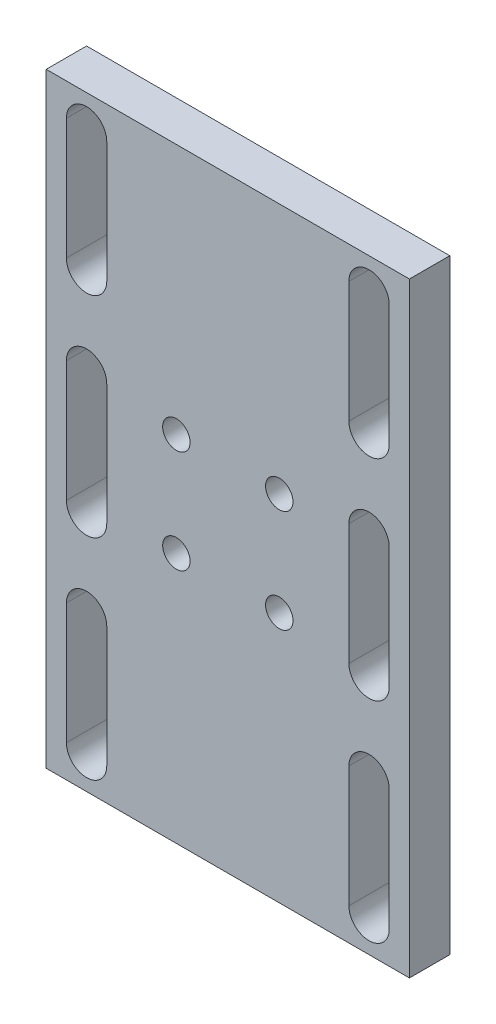
ISO-10303-21;
HEADER;
FILE_DESCRIPTION(('STEP AP214'),'2;1');
FILE_NAME('part.step','',(''),(''),'','','');
FILE_SCHEMA(('AUTOMOTIVE_DESIGN { 1 0 10303 214 1 1 1 1 }'));
ENDSEC;
DATA;
#1=APPLICATION_CONTEXT('core data for automotive mechanical design processes');
#2=APPLICATION_PROTOCOL_DEFINITION('international standard','automotive_design',2000,#1);
#3=PRODUCT_CONTEXT('',#1,'mechanical');
#4=PRODUCT('Part','Part','',(#3));
#5=PRODUCT_RELATED_PRODUCT_CATEGORY('part','',(#4));
#6=PRODUCT_DEFINITION_FORMATION('','',#4);
#7=PRODUCT_DEFINITION_CONTEXT('part definition',#1,'design');
#8=PRODUCT_DEFINITION('design','',#6,#7);
#9=PRODUCT_DEFINITION_SHAPE('','',#8);
#10=(LENGTH_UNIT() NAMED_UNIT(*) SI_UNIT(.MILLI.,.METRE.));
#11=(NAMED_UNIT(*) PLANE_ANGLE_UNIT() SI_UNIT($,.RADIAN.));
#12=(NAMED_UNIT(*) SI_UNIT($,.STERADIAN.) SOLID_ANGLE_UNIT());
#13=UNCERTAINTY_MEASURE_WITH_UNIT(LENGTH_MEASURE(1.E-05),#10,'distance_accuracy_value','');
#14=(GEOMETRIC_REPRESENTATION_CONTEXT(3) GLOBAL_UNCERTAINTY_ASSIGNED_CONTEXT((#13)) GLOBAL_UNIT_ASSIGNED_CONTEXT((#10,
#11,#12)) REPRESENTATION_CONTEXT('',''));
#15=CARTESIAN_POINT('',(0.,0.,0.));
#16=DIRECTION('',(0.,0.,1.));
#17=DIRECTION('',(1.,0.,0.));
#18=AXIS2_PLACEMENT_3D('',#15,#16,#17);
#19=CARTESIAN_POINT('',(-45.,0.,10.));
#20=DIRECTION('',(1.,0.,0.));
#21=DIRECTION('',(0.,1.,0.));
#22=AXIS2_PLACEMENT_3D('',#19,#20,#21);
#23=PLANE('',#22);
#24=DIRECTION('',(0.,-1.,0.));
#25=VECTOR('',#24,1.);
#26=CARTESIAN_POINT('',(-45.,0.,0.));
#27=LINE('',#26,#25);
#28=CARTESIAN_POINT('',(-45.,150.,0.));
#29=VERTEX_POINT('',#28);
#30=CARTESIAN_POINT('',(-45.,0.,0.));
#31=VERTEX_POINT('',#30);
#32=EDGE_CURVE('E322',#29,#31,#27,.T.);
#33=ORIENTED_EDGE('',*,*,#32,.T.);
#34=DIRECTION('',(0.,0.,-1.));
#35=VECTOR('',#34,1.);
#36=CARTESIAN_POINT('',(-45.,0.,10.));
#37=LINE('',#36,#35);
#38=CARTESIAN_POINT('',(-45.,0.,10.));
#39=VERTEX_POINT('',#38);
#40=EDGE_CURVE('E11',#39,#31,#37,.T.);
#41=ORIENTED_EDGE('',*,*,#40,.F.);
#42=DIRECTION('',(0.,-1.,0.));
#43=VECTOR('',#42,1.);
#44=CARTESIAN_POINT('',(-45.,0.,10.));
#45=LINE('',#44,#43);
#46=CARTESIAN_POINT('',(-45.,150.,10.));
#47=VERTEX_POINT('',#46);
#48=EDGE_CURVE('E235',#47,#39,#45,.T.);
#49=ORIENTED_EDGE('',*,*,#48,.F.);
#50=DIRECTION('',(0.,0.,-1.));
#51=VECTOR('',#50,1.);
#52=CARTESIAN_POINT('',(-45.,150.,10.));
#53=LINE('',#52,#51);
#54=EDGE_CURVE('E54',#47,#29,#53,.T.);
#55=ORIENTED_EDGE('',*,*,#54,.T.);
#56=EDGE_LOOP('',(#33,#41,#49,#55));
#57=FACE_BOUND('',#56,.T.);
#58=ADVANCED_FACE('F35',(#57),#23,.F.);
#59=CARTESIAN_POINT('',(0.,0.,10.));
#60=DIRECTION('',(0.,1.,0.));
#61=DIRECTION('',(0.,0.,1.));
#62=AXIS2_PLACEMENT_3D('',#59,#60,#61);
#63=PLANE('',#62);
#64=DIRECTION('',(1.,0.,0.));
#65=VECTOR('',#64,1.);
#66=CARTESIAN_POINT('',(0.,0.,0.));
#67=LINE('',#66,#65);
#68=CARTESIAN_POINT('',(45.,0.,0.));
#69=VERTEX_POINT('',#68);
#70=EDGE_CURVE('E241',#31,#69,#67,.T.);
#71=ORIENTED_EDGE('',*,*,#70,.T.);
#72=DIRECTION('',(0.,0.,-1.));
#73=VECTOR('',#72,1.);
#74=CARTESIAN_POINT('',(45.,0.,10.));
#75=LINE('',#74,#73);
#76=CARTESIAN_POINT('',(45.,0.,10.));
#77=VERTEX_POINT('',#76);
#78=EDGE_CURVE('E45',#77,#69,#75,.T.);
#79=ORIENTED_EDGE('',*,*,#78,.F.);
#80=DIRECTION('',(1.,0.,0.));
#81=VECTOR('',#80,1.);
#82=CARTESIAN_POINT('',(0.,0.,10.));
#83=LINE('',#82,#81);
#84=EDGE_CURVE('E229',#39,#77,#83,.T.);
#85=ORIENTED_EDGE('',*,*,#84,.F.);
#86=ORIENTED_EDGE('',*,*,#40,.T.);
#87=EDGE_LOOP('',(#71,#79,#85,#86));
#88=FACE_BOUND('',#87,.T.);
#89=ADVANCED_FACE('F240',(#88),#63,.F.);
#90=CARTESIAN_POINT('',(45.,0.,10.));
#91=DIRECTION('',(1.,0.,0.));
#92=DIRECTION('',(0.,1.,0.));
#93=AXIS2_PLACEMENT_3D('',#90,#91,#92);
#94=PLANE('',#93);
#95=DIRECTION('',(0.,-1.,0.));
#96=VECTOR('',#95,1.);
#97=CARTESIAN_POINT('',(45.,0.,0.));
#98=LINE('',#97,#96);
#99=CARTESIAN_POINT('',(45.,150.,0.));
#100=VERTEX_POINT('',#99);
#101=EDGE_CURVE('E325',#100,#69,#98,.T.);
#102=ORIENTED_EDGE('',*,*,#101,.F.);
#103=DIRECTION('',(0.,0.,-1.));
#104=VECTOR('',#103,1.);
#105=CARTESIAN_POINT('',(45.,150.,10.));
#106=LINE('',#105,#104);
#107=CARTESIAN_POINT('',(45.,150.,10.));
#108=VERTEX_POINT('',#107);
#109=EDGE_CURVE('E140',#108,#100,#106,.T.);
#110=ORIENTED_EDGE('',*,*,#109,.F.);
#111=DIRECTION('',(0.,-1.,0.));
#112=VECTOR('',#111,1.);
#113=CARTESIAN_POINT('',(45.,0.,10.));
#114=LINE('',#113,#112);
#115=EDGE_CURVE('E234',#108,#77,#114,.T.);
#116=ORIENTED_EDGE('',*,*,#115,.T.);
#117=ORIENTED_EDGE('',*,*,#78,.T.);
#118=EDGE_LOOP('',(#102,#110,#116,#117));
#119=FACE_BOUND('',#118,.T.);
#120=ADVANCED_FACE('F245',(#119),#94,.T.);
#121=CARTESIAN_POINT('',(35.,112.,10.));
#122=DIRECTION('',(0.,0.,-1.));
#123=DIRECTION('',(-1.,0.,0.));
#124=AXIS2_PLACEMENT_3D('',#121,#122,#123);
#125=CYLINDRICAL_SURFACE('',#124,5.00000000000001);
#126=CARTESIAN_POINT('',(35.,112.,0.));
#127=DIRECTION('',(0.,0.,1.));
#128=DIRECTION('',(1.,0.,0.));
#129=AXIS2_PLACEMENT_3D('',#126,#127,#128);
#130=CIRCLE('',#129,5.00000000000001);
#131=CARTESIAN_POINT('',(30.,112.,0.));
#132=VERTEX_POINT('',#131);
#133=CARTESIAN_POINT('',(40.,112.,0.));
#134=VERTEX_POINT('',#133);
#135=EDGE_CURVE('E310',#132,#134,#130,.T.);
#136=ORIENTED_EDGE('',*,*,#135,.F.);
#137=DIRECTION('',(0.,0.,-1.));
#138=VECTOR('',#137,1.);
#139=CARTESIAN_POINT('',(30.,112.,10.));
#140=LINE('',#139,#138);
#141=CARTESIAN_POINT('',(30.,112.,10.));
#142=VERTEX_POINT('',#141);
#143=EDGE_CURVE('E332',#142,#132,#140,.T.);
#144=ORIENTED_EDGE('',*,*,#143,.F.);
#145=CARTESIAN_POINT('',(35.,112.,10.));
#146=DIRECTION('',(0.,0.,1.));
#147=DIRECTION('',(1.,0.,0.));
#148=AXIS2_PLACEMENT_3D('',#145,#146,#147);
#149=CIRCLE('',#148,5.00000000000001);
#150=CARTESIAN_POINT('',(40.,112.,10.));
#151=VERTEX_POINT('',#150);
#152=EDGE_CURVE('E450',#142,#151,#149,.T.);
#153=ORIENTED_EDGE('',*,*,#152,.T.);
#154=DIRECTION('',(0.,0.,-1.));
#155=VECTOR('',#154,1.);
#156=CARTESIAN_POINT('',(40.,112.,10.));
#157=LINE('',#156,#155);
#158=EDGE_CURVE('E334',#151,#134,#157,.T.);
#159=ORIENTED_EDGE('',*,*,#158,.T.);
#160=EDGE_LOOP('',(#136,#144,#153,#159));
#161=FACE_BOUND('',#160,.T.);
#162=ADVANCED_FACE('F471',(#161),#125,.F.);
#163=CARTESIAN_POINT('',(30.,0.,10.));
#164=DIRECTION('',(1.,0.,0.));
#165=DIRECTION('',(0.,0.,-1.));
#166=AXIS2_PLACEMENT_3D('',#163,#164,#165);
#167=PLANE('',#166);
#168=DIRECTION('',(0.,-1.,0.));
#169=VECTOR('',#168,1.);
#170=CARTESIAN_POINT('',(30.,0.,0.));
#171=LINE('',#170,#169);
#172=CARTESIAN_POINT('',(30.,142.,0.));
#173=VERTEX_POINT('',#172);
#174=EDGE_CURVE('E313',#173,#132,#171,.T.);
#175=ORIENTED_EDGE('',*,*,#174,.F.);
#176=DIRECTION('',(0.,0.,-1.));
#177=VECTOR('',#176,1.);
#178=CARTESIAN_POINT('',(30.,142.,10.));
#179=LINE('',#178,#177);
#180=CARTESIAN_POINT('',(30.,142.,10.));
#181=VERTEX_POINT('',#180);
#182=EDGE_CURVE('E339',#181,#173,#179,.T.);
#183=ORIENTED_EDGE('',*,*,#182,.F.);
#184=DIRECTION('',(0.,-1.,0.));
#185=VECTOR('',#184,1.);
#186=CARTESIAN_POINT('',(30.,0.,10.));
#187=LINE('',#186,#185);
#188=EDGE_CURVE('E453',#181,#142,#187,.T.);
#189=ORIENTED_EDGE('',*,*,#188,.T.);
#190=ORIENTED_EDGE('',*,*,#143,.T.);
#191=EDGE_LOOP('',(#175,#183,#189,#190));
#192=FACE_BOUND('',#191,.T.);
#193=ADVANCED_FACE('F474',(#192),#167,.T.);
#194=CARTESIAN_POINT('',(35.,142.,10.));
#195=DIRECTION('',(0.,0.,-1.));
#196=DIRECTION('',(-1.,0.,0.));
#197=AXIS2_PLACEMENT_3D('',#194,#195,#196);
#198=CYLINDRICAL_SURFACE('',#197,5.00000000000001);
#199=CARTESIAN_POINT('',(35.,142.,0.));
#200=DIRECTION('',(0.,0.,1.));
#201=DIRECTION('',(1.,0.,0.));
#202=AXIS2_PLACEMENT_3D('',#199,#200,#201);
#203=CIRCLE('',#202,5.00000000000001);
#204=CARTESIAN_POINT('',(40.,142.,0.));
#205=VERTEX_POINT('',#204);
#206=EDGE_CURVE('E316',#205,#173,#203,.T.);
#207=ORIENTED_EDGE('',*,*,#206,.F.);
#208=DIRECTION('',(0.,0.,-1.));
#209=VECTOR('',#208,1.);
#210=CARTESIAN_POINT('',(40.,142.,10.));
#211=LINE('',#210,#209);
#212=CARTESIAN_POINT('',(40.,142.,10.));
#213=VERTEX_POINT('',#212);
#214=EDGE_CURVE('E336',#213,#205,#211,.T.);
#215=ORIENTED_EDGE('',*,*,#214,.F.);
#216=CARTESIAN_POINT('',(35.,142.,10.));
#217=DIRECTION('',(0.,0.,1.));
#218=DIRECTION('',(1.,0.,0.));
#219=AXIS2_PLACEMENT_3D('',#216,#217,#218);
#220=CIRCLE('',#219,5.00000000000001);
#221=EDGE_CURVE('E456',#213,#181,#220,.T.);
#222=ORIENTED_EDGE('',*,*,#221,.T.);
#223=ORIENTED_EDGE('',*,*,#182,.T.);
#224=EDGE_LOOP('',(#207,#215,#222,#223));
#225=FACE_BOUND('',#224,.T.);
#226=ADVANCED_FACE('F477',(#225),#198,.F.);
#227=CARTESIAN_POINT('',(-30.,0.,10.));
#228=DIRECTION('',(1.,0.,0.));
#229=DIRECTION('',(0.,0.,-1.));
#230=AXIS2_PLACEMENT_3D('',#227,#228,#229);
#231=PLANE('',#230);
#232=DIRECTION('',(0.,-1.,0.));
#233=VECTOR('',#232,1.);
#234=CARTESIAN_POINT('',(-30.,0.,0.));
#235=LINE('',#234,#233);
#236=CARTESIAN_POINT('',(-30.,142.,0.));
#237=VERTEX_POINT('',#236);
#238=CARTESIAN_POINT('',(-30.,112.,0.));
#239=VERTEX_POINT('',#238);
#240=EDGE_CURVE('E299',#237,#239,#235,.T.);
#241=ORIENTED_EDGE('',*,*,#240,.T.);
#242=DIRECTION('',(0.,0.,-1.));
#243=VECTOR('',#242,1.);
#244=CARTESIAN_POINT('',(-30.,112.,10.));
#245=LINE('',#244,#243);
#246=CARTESIAN_POINT('',(-30.,112.,10.));
#247=VERTEX_POINT('',#246);
#248=EDGE_CURVE('E337',#247,#239,#245,.T.);
#249=ORIENTED_EDGE('',*,*,#248,.F.);
#250=DIRECTION('',(0.,-1.,0.));
#251=VECTOR('',#250,1.);
#252=CARTESIAN_POINT('',(-30.,0.,10.));
#253=LINE('',#252,#251);
#254=CARTESIAN_POINT('',(-30.,142.,10.));
#255=VERTEX_POINT('',#254);
#256=EDGE_CURVE('E440',#255,#247,#253,.T.);
#257=ORIENTED_EDGE('',*,*,#256,.F.);
#258=DIRECTION('',(0.,0.,-1.));
#259=VECTOR('',#258,1.);
#260=CARTESIAN_POINT('',(-30.,142.,10.));
#261=LINE('',#260,#259);
#262=EDGE_CURVE('E342',#255,#237,#261,.T.);
#263=ORIENTED_EDGE('',*,*,#262,.T.);
#264=EDGE_LOOP('',(#241,#249,#257,#263));
#265=FACE_BOUND('',#264,.T.);
#266=ADVANCED_FACE('F504',(#265),#231,.F.);
#267=CARTESIAN_POINT('',(-35.,112.,10.));
#268=DIRECTION('',(0.,0.,-1.));
#269=DIRECTION('',(-1.,0.,0.));
#270=AXIS2_PLACEMENT_3D('',#267,#268,#269);
#271=CYLINDRICAL_SURFACE('',#270,5.00000000000001);
#272=CARTESIAN_POINT('',(-35.,112.,0.));
#273=DIRECTION('',(0.,0.,1.));
#274=DIRECTION('',(1.,0.,0.));
#275=AXIS2_PLACEMENT_3D('',#272,#273,#274);
#276=CIRCLE('',#275,5.00000000000001);
#277=CARTESIAN_POINT('',(-40.,112.,0.));
#278=VERTEX_POINT('',#277);
#279=EDGE_CURVE('E302',#239,#278,#276,.F.);
#280=ORIENTED_EDGE('',*,*,#279,.T.);
#281=DIRECTION('',(0.,0.,-1.));
#282=VECTOR('',#281,1.);
#283=CARTESIAN_POINT('',(-40.,112.,10.));
#284=LINE('',#283,#282);
#285=CARTESIAN_POINT('',(-40.,112.,10.));
#286=VERTEX_POINT('',#285);
#287=EDGE_CURVE('E348',#286,#278,#284,.T.);
#288=ORIENTED_EDGE('',*,*,#287,.F.);
#289=CARTESIAN_POINT('',(-35.,112.,10.));
#290=DIRECTION('',(0.,0.,1.));
#291=DIRECTION('',(1.,0.,0.));
#292=AXIS2_PLACEMENT_3D('',#289,#290,#291);
#293=CIRCLE('',#292,5.00000000000001);
#294=EDGE_CURVE('E443',#247,#286,#293,.F.);
#295=ORIENTED_EDGE('',*,*,#294,.F.);
#296=ORIENTED_EDGE('',*,*,#248,.T.);
#297=EDGE_LOOP('',(#280,#288,#295,#296));
#298=FACE_BOUND('',#297,.T.);
#299=ADVANCED_FACE('F517',(#298),#271,.F.);
#300=CARTESIAN_POINT('',(-40.,0.,10.));
#301=DIRECTION('',(1.,0.,0.));
#302=DIRECTION('',(0.,0.,-1.));
#303=AXIS2_PLACEMENT_3D('',#300,#301,#302);
#304=PLANE('',#303);
#305=DIRECTION('',(0.,-1.,0.));
#306=VECTOR('',#305,1.);
#307=CARTESIAN_POINT('',(-40.,0.,0.));
#308=LINE('',#307,#306);
#309=CARTESIAN_POINT('',(-40.,142.,0.));
#310=VERTEX_POINT('',#309);
#311=EDGE_CURVE('E305',#310,#278,#308,.T.);
#312=ORIENTED_EDGE('',*,*,#311,.F.);
#313=DIRECTION('',(0.,0.,-1.));
#314=VECTOR('',#313,1.);
#315=CARTESIAN_POINT('',(-40.,142.,10.));
#316=LINE('',#315,#314);
#317=CARTESIAN_POINT('',(-40.,142.,10.));
#318=VERTEX_POINT('',#317);
#319=EDGE_CURVE('E345',#318,#310,#316,.T.);
#320=ORIENTED_EDGE('',*,*,#319,.F.);
#321=DIRECTION('',(0.,-1.,0.));
#322=VECTOR('',#321,1.);
#323=CARTESIAN_POINT('',(-40.,0.,10.));
#324=LINE('',#323,#322);
#325=EDGE_CURVE('E445',#318,#286,#324,.T.);
#326=ORIENTED_EDGE('',*,*,#325,.T.);
#327=ORIENTED_EDGE('',*,*,#287,.T.);
#328=EDGE_LOOP('',(#312,#320,#326,#327));
#329=FACE_BOUND('',#328,.T.);
#330=ADVANCED_FACE('F513',(#329),#304,.T.);
#331=CARTESIAN_POINT('',(30.,0.,10.));
#332=DIRECTION('',(-1.,0.,0.));
#333=DIRECTION('',(0.,-1.,0.));
#334=AXIS2_PLACEMENT_3D('',#331,#332,#333);
#335=PLANE('',#334);
#336=DIRECTION('',(0.,1.,0.));
#337=VECTOR('',#336,1.);
#338=CARTESIAN_POINT('',(30.,0.,0.));
#339=LINE('',#338,#337);
#340=CARTESIAN_POINT('',(30.,60.,0.));
#341=VERTEX_POINT('',#340);
#342=CARTESIAN_POINT('',(30.,90.,0.));
#343=VERTEX_POINT('',#342);
#344=EDGE_CURVE('E288',#341,#343,#339,.T.);
#345=ORIENTED_EDGE('',*,*,#344,.T.);
#346=DIRECTION('',(0.,0.,-1.));
#347=VECTOR('',#346,1.);
#348=CARTESIAN_POINT('',(30.,90.,10.));
#349=LINE('',#348,#347);
#350=CARTESIAN_POINT('',(30.,90.,10.));
#351=VERTEX_POINT('',#350);
#352=EDGE_CURVE('E346',#351,#343,#349,.T.);
#353=ORIENTED_EDGE('',*,*,#352,.F.);
#354=DIRECTION('',(0.,1.,0.));
#355=VECTOR('',#354,1.);
#356=CARTESIAN_POINT('',(30.,0.,10.));
#357=LINE('',#356,#355);
#358=CARTESIAN_POINT('',(30.,60.,10.));
#359=VERTEX_POINT('',#358);
#360=EDGE_CURVE('E430',#359,#351,#357,.T.);
#361=ORIENTED_EDGE('',*,*,#360,.F.);
#362=DIRECTION('',(0.,0.,-1.));
#363=VECTOR('',#362,1.);
#364=CARTESIAN_POINT('',(30.,60.,10.));
#365=LINE('',#364,#363);
#366=EDGE_CURVE('E352',#359,#341,#365,.T.);
#367=ORIENTED_EDGE('',*,*,#366,.T.);
#368=EDGE_LOOP('',(#345,#353,#361,#367));
#369=FACE_BOUND('',#368,.T.);
#370=ADVANCED_FACE('F516',(#369),#335,.F.);
#371=CARTESIAN_POINT('',(35.,90.,10.));
#372=DIRECTION('',(0.,0.,-1.));
#373=DIRECTION('',(-1.,0.,0.));
#374=AXIS2_PLACEMENT_3D('',#371,#372,#373);
#375=CYLINDRICAL_SURFACE('',#374,5.00000000000001);
#376=CARTESIAN_POINT('',(35.,90.,0.));
#377=DIRECTION('',(0.,0.,1.));
#378=DIRECTION('',(1.,0.,0.));
#379=AXIS2_PLACEMENT_3D('',#376,#377,#378);
#380=CIRCLE('',#379,5.00000000000001);
#381=CARTESIAN_POINT('',(40.,90.,0.));
#382=VERTEX_POINT('',#381);
#383=EDGE_CURVE('E291',#343,#382,#380,.F.);
#384=ORIENTED_EDGE('',*,*,#383,.T.);
#385=DIRECTION('',(0.,0.,-1.));
#386=VECTOR('',#385,1.);
#387=CARTESIAN_POINT('',(40.,90.,10.));
#388=LINE('',#387,#386);
#389=CARTESIAN_POINT('',(40.,90.,10.));
#390=VERTEX_POINT('',#389);
#391=EDGE_CURVE('E358',#390,#382,#388,.T.);
#392=ORIENTED_EDGE('',*,*,#391,.F.);
#393=CARTESIAN_POINT('',(35.,90.,10.));
#394=DIRECTION('',(0.,0.,1.));
#395=DIRECTION('',(1.,0.,0.));
#396=AXIS2_PLACEMENT_3D('',#393,#394,#395);
#397=CIRCLE('',#396,5.00000000000001);
#398=EDGE_CURVE('E433',#351,#390,#397,.F.);
#399=ORIENTED_EDGE('',*,*,#398,.F.);
#400=ORIENTED_EDGE('',*,*,#352,.T.);
#401=EDGE_LOOP('',(#384,#392,#399,#400));
#402=FACE_BOUND('',#401,.T.);
#403=ADVANCED_FACE('F533',(#402),#375,.F.);
#404=CARTESIAN_POINT('',(40.,0.,10.));
#405=DIRECTION('',(-1.,0.,0.));
#406=DIRECTION('',(0.,0.,1.));
#407=AXIS2_PLACEMENT_3D('',#404,#405,#406);
#408=PLANE('',#407);
#409=DIRECTION('',(0.,1.,0.));
#410=VECTOR('',#409,1.);
#411=CARTESIAN_POINT('',(40.,0.,0.));
#412=LINE('',#411,#410);
#413=CARTESIAN_POINT('',(40.,60.,0.));
#414=VERTEX_POINT('',#413);
#415=EDGE_CURVE('E294',#414,#382,#412,.T.);
#416=ORIENTED_EDGE('',*,*,#415,.F.);
#417=DIRECTION('',(0.,0.,-1.));
#418=VECTOR('',#417,1.);
#419=CARTESIAN_POINT('',(40.,60.,10.));
#420=LINE('',#419,#418);
#421=CARTESIAN_POINT('',(40.,60.,10.));
#422=VERTEX_POINT('',#421);
#423=EDGE_CURVE('E355',#422,#414,#420,.T.);
#424=ORIENTED_EDGE('',*,*,#423,.F.);
#425=DIRECTION('',(0.,1.,0.));
#426=VECTOR('',#425,1.);
#427=CARTESIAN_POINT('',(40.,0.,10.));
#428=LINE('',#427,#426);
#429=EDGE_CURVE('E435',#422,#390,#428,.T.);
#430=ORIENTED_EDGE('',*,*,#429,.T.);
#431=ORIENTED_EDGE('',*,*,#391,.T.);
#432=EDGE_LOOP('',(#416,#424,#430,#431));
#433=FACE_BOUND('',#432,.T.);
#434=ADVANCED_FACE('F529',(#433),#408,.T.);
#435=CARTESIAN_POINT('',(-35.,90.,10.));
#436=DIRECTION('',(0.,0.,-1.));
#437=DIRECTION('',(-1.,0.,0.));
#438=AXIS2_PLACEMENT_3D('',#435,#436,#437);
#439=CYLINDRICAL_SURFACE('',#438,5.00000000000001);
#440=CARTESIAN_POINT('',(-35.,90.,0.));
#441=DIRECTION('',(0.,0.,1.));
#442=DIRECTION('',(1.,0.,0.));
#443=AXIS2_PLACEMENT_3D('',#440,#441,#442);
#444=CIRCLE('',#443,5.00000000000001);
#445=CARTESIAN_POINT('',(-30.,90.,0.));
#446=VERTEX_POINT('',#445);
#447=CARTESIAN_POINT('',(-40.,90.,0.));
#448=VERTEX_POINT('',#447);
#449=EDGE_CURVE('E276',#446,#448,#444,.T.);
#450=ORIENTED_EDGE('',*,*,#449,.F.);
#451=DIRECTION('',(0.,0.,-1.));
#452=VECTOR('',#451,1.);
#453=CARTESIAN_POINT('',(-30.,90.,10.));
#454=LINE('',#453,#452);
#455=CARTESIAN_POINT('',(-30.,90.,10.));
#456=VERTEX_POINT('',#455);
#457=EDGE_CURVE('E356',#456,#446,#454,.T.);
#458=ORIENTED_EDGE('',*,*,#457,.F.);
#459=CARTESIAN_POINT('',(-35.,90.,10.));
#460=DIRECTION('',(0.,0.,1.));
#461=DIRECTION('',(1.,0.,0.));
#462=AXIS2_PLACEMENT_3D('',#459,#460,#461);
#463=CIRCLE('',#462,5.00000000000001);
#464=CARTESIAN_POINT('',(-40.,90.,10.));
#465=VERTEX_POINT('',#464);
#466=EDGE_CURVE('E419',#456,#465,#463,.T.);
#467=ORIENTED_EDGE('',*,*,#466,.T.);
#468=DIRECTION('',(0.,0.,-1.));
#469=VECTOR('',#468,1.);
#470=CARTESIAN_POINT('',(-40.,90.,10.));
#471=LINE('',#470,#469);
#472=EDGE_CURVE('E362',#465,#448,#471,.T.);
#473=ORIENTED_EDGE('',*,*,#472,.T.);
#474=EDGE_LOOP('',(#450,#458,#467,#473));
#475=FACE_BOUND('',#474,.T.);
#476=ADVANCED_FACE('F532',(#475),#439,.F.);
#477=CARTESIAN_POINT('',(-30.,0.,10.));
#478=DIRECTION('',(-1.,0.,0.));
#479=DIRECTION('',(0.,-1.,0.));
#480=AXIS2_PLACEMENT_3D('',#477,#478,#479);
#481=PLANE('',#480);
#482=DIRECTION('',(0.,1.,0.));
#483=VECTOR('',#482,1.);
#484=CARTESIAN_POINT('',(-30.,0.,0.));
#485=LINE('',#484,#483);
#486=CARTESIAN_POINT('',(-30.,60.,0.));
#487=VERTEX_POINT('',#486);
#488=EDGE_CURVE('E279',#487,#446,#485,.T.);
#489=ORIENTED_EDGE('',*,*,#488,.F.);
#490=DIRECTION('',(0.,0.,-1.));
#491=VECTOR('',#490,1.);
#492=CARTESIAN_POINT('',(-30.,60.,10.));
#493=LINE('',#492,#491);
#494=CARTESIAN_POINT('',(-30.,60.,10.));
#495=VERTEX_POINT('',#494);
#496=EDGE_CURVE('E367',#495,#487,#493,.T.);
#497=ORIENTED_EDGE('',*,*,#496,.F.);
#498=DIRECTION('',(0.,1.,0.));
#499=VECTOR('',#498,1.);
#500=CARTESIAN_POINT('',(-30.,0.,10.));
#501=LINE('',#500,#499);
#502=EDGE_CURVE('E422',#495,#456,#501,.T.);
#503=ORIENTED_EDGE('',*,*,#502,.T.);
#504=ORIENTED_EDGE('',*,*,#457,.T.);
#505=EDGE_LOOP('',(#489,#497,#503,#504));
#506=FACE_BOUND('',#505,.T.);
#507=ADVANCED_FACE('F549',(#506),#481,.T.);
#508=CARTESIAN_POINT('',(-35.,60.,10.));
#509=DIRECTION('',(0.,0.,-1.));
#510=DIRECTION('',(-1.,0.,0.));
#511=AXIS2_PLACEMENT_3D('',#508,#509,#510);
#512=CYLINDRICAL_SURFACE('',#511,5.00000000000001);
#513=CARTESIAN_POINT('',(-35.,60.,0.));
#514=DIRECTION('',(0.,0.,1.));
#515=DIRECTION('',(1.,0.,0.));
#516=AXIS2_PLACEMENT_3D('',#513,#514,#515);
#517=CIRCLE('',#516,5.00000000000001);
#518=CARTESIAN_POINT('',(-40.,60.,0.));
#519=VERTEX_POINT('',#518);
#520=EDGE_CURVE('E282',#519,#487,#517,.T.);
#521=ORIENTED_EDGE('',*,*,#520,.F.);
#522=DIRECTION('',(0.,0.,-1.));
#523=VECTOR('',#522,1.);
#524=CARTESIAN_POINT('',(-40.,60.,10.));
#525=LINE('',#524,#523);
#526=CARTESIAN_POINT('',(-40.,60.,10.));
#527=VERTEX_POINT('',#526);
#528=EDGE_CURVE('E364',#527,#519,#525,.T.);
#529=ORIENTED_EDGE('',*,*,#528,.F.);
#530=CARTESIAN_POINT('',(-35.,60.,10.));
#531=DIRECTION('',(0.,0.,1.));
#532=DIRECTION('',(1.,0.,0.));
#533=AXIS2_PLACEMENT_3D('',#530,#531,#532);
#534=CIRCLE('',#533,5.00000000000001);
#535=EDGE_CURVE('E425',#527,#495,#534,.T.);
#536=ORIENTED_EDGE('',*,*,#535,.T.);
#537=ORIENTED_EDGE('',*,*,#496,.T.);
#538=EDGE_LOOP('',(#521,#529,#536,#537));
#539=FACE_BOUND('',#538,.T.);
#540=ADVANCED_FACE('F545',(#539),#512,.F.);
#541=CARTESIAN_POINT('',(-35.,38.,10.));
#542=DIRECTION('',(0.,0.,-1.));
#543=DIRECTION('',(-1.,0.,0.));
#544=AXIS2_PLACEMENT_3D('',#541,#542,#543);
#545=CYLINDRICAL_SURFACE('',#544,5.00000000000001);
#546=CARTESIAN_POINT('',(-35.,38.,0.));
#547=DIRECTION('',(0.,0.,1.));
#548=DIRECTION('',(1.,0.,0.));
#549=AXIS2_PLACEMENT_3D('',#546,#547,#548);
#550=CIRCLE('',#549,5.00000000000001);
#551=CARTESIAN_POINT('',(-30.,38.,0.));
#552=VERTEX_POINT('',#551);
#553=CARTESIAN_POINT('',(-40.,38.,0.));
#554=VERTEX_POINT('',#553);
#555=EDGE_CURVE('E264',#552,#554,#550,.T.);
#556=ORIENTED_EDGE('',*,*,#555,.F.);
#557=DIRECTION('',(0.,0.,-1.));
#558=VECTOR('',#557,1.);
#559=CARTESIAN_POINT('',(-30.,38.,10.));
#560=LINE('',#559,#558);
#561=CARTESIAN_POINT('',(-30.,38.,10.));
#562=VERTEX_POINT('',#561);
#563=EDGE_CURVE('E365',#562,#552,#560,.T.);
#564=ORIENTED_EDGE('',*,*,#563,.F.);
#565=CARTESIAN_POINT('',(-35.,38.,10.));
#566=DIRECTION('',(0.,0.,1.));
#567=DIRECTION('',(1.,0.,0.));
#568=AXIS2_PLACEMENT_3D('',#565,#566,#567);
#569=CIRCLE('',#568,5.00000000000001);
#570=CARTESIAN_POINT('',(-40.,38.,10.));
#571=VERTEX_POINT('',#570);
#572=EDGE_CURVE('E402',#562,#571,#569,.T.);
#573=ORIENTED_EDGE('',*,*,#572,.T.);
#574=DIRECTION('',(0.,0.,-1.));
#575=VECTOR('',#574,1.);
#576=CARTESIAN_POINT('',(-40.,38.,10.));
#577=LINE('',#576,#575);
#578=EDGE_CURVE('E370',#571,#554,#577,.T.);
#579=ORIENTED_EDGE('',*,*,#578,.T.);
#580=EDGE_LOOP('',(#556,#564,#573,#579));
#581=FACE_BOUND('',#580,.T.);
#582=ADVANCED_FACE('F548',(#581),#545,.F.);
#583=CARTESIAN_POINT('',(-30.,0.,10.));
#584=DIRECTION('',(-1.,0.,0.));
#585=DIRECTION('',(0.,0.,1.));
#586=AXIS2_PLACEMENT_3D('',#583,#584,#585);
#587=PLANE('',#586);
#588=DIRECTION('',(0.,1.,0.));
#589=VECTOR('',#588,1.);
#590=CARTESIAN_POINT('',(-30.,0.,0.));
#591=LINE('',#590,#589);
#592=CARTESIAN_POINT('',(-30.,7.99999999999999,0.));
#593=VERTEX_POINT('',#592);
#594=EDGE_CURVE('E267',#593,#552,#591,.T.);
#595=ORIENTED_EDGE('',*,*,#594,.F.);
#596=DIRECTION('',(0.,0.,-1.));
#597=VECTOR('',#596,1.);
#598=CARTESIAN_POINT('',(-30.,7.99999999999999,10.));
#599=LINE('',#598,#597);
#600=CARTESIAN_POINT('',(-30.,7.99999999999999,10.));
#601=VERTEX_POINT('',#600);
#602=EDGE_CURVE('E374',#601,#593,#599,.T.);
#603=ORIENTED_EDGE('',*,*,#602,.F.);
#604=DIRECTION('',(0.,1.,0.));
#605=VECTOR('',#604,1.);
#606=CARTESIAN_POINT('',(-30.,0.,10.));
#607=LINE('',#606,#605);
#608=EDGE_CURVE('E411',#601,#562,#607,.T.);
#609=ORIENTED_EDGE('',*,*,#608,.T.);
#610=ORIENTED_EDGE('',*,*,#563,.T.);
#611=EDGE_LOOP('',(#595,#603,#609,#610));
#612=FACE_BOUND('',#611,.T.);
#613=ADVANCED_FACE('F563',(#612),#587,.T.);
#614=CARTESIAN_POINT('',(-35.,7.99999999999999,10.));
#615=DIRECTION('',(0.,0.,-1.));
#616=DIRECTION('',(-1.,0.,0.));
#617=AXIS2_PLACEMENT_3D('',#614,#615,#616);
#618=CYLINDRICAL_SURFACE('',#617,5.00000000000001);
#619=CARTESIAN_POINT('',(-35.,7.99999999999999,0.));
#620=DIRECTION('',(0.,0.,1.));
#621=DIRECTION('',(1.,0.,0.));
#622=AXIS2_PLACEMENT_3D('',#619,#620,#621);
#623=CIRCLE('',#622,5.00000000000001);
#624=CARTESIAN_POINT('',(-40.,7.99999999999999,0.));
#625=VERTEX_POINT('',#624);
#626=EDGE_CURVE('E270',#625,#593,#623,.T.);
#627=ORIENTED_EDGE('',*,*,#626,.F.);
#628=DIRECTION('',(0.,0.,-1.));
#629=VECTOR('',#628,1.);
#630=CARTESIAN_POINT('',(-40.,7.99999999999999,10.));
#631=LINE('',#630,#629);
#632=CARTESIAN_POINT('',(-40.,7.99999999999999,10.));
#633=VERTEX_POINT('',#632);
#634=EDGE_CURVE('E372',#633,#625,#631,.T.);
#635=ORIENTED_EDGE('',*,*,#634,.F.);
#636=CARTESIAN_POINT('',(-35.,7.99999999999999,10.));
#637=DIRECTION('',(0.,0.,1.));
#638=DIRECTION('',(1.,0.,0.));
#639=AXIS2_PLACEMENT_3D('',#636,#637,#638);
#640=CIRCLE('',#639,5.00000000000001);
#641=EDGE_CURVE('E414',#633,#601,#640,.T.);
#642=ORIENTED_EDGE('',*,*,#641,.T.);
#643=ORIENTED_EDGE('',*,*,#602,.T.);
#644=EDGE_LOOP('',(#627,#635,#642,#643));
#645=FACE_BOUND('',#644,.T.);
#646=ADVANCED_FACE('F560',(#645),#618,.F.);
#647=CARTESIAN_POINT('',(30.,0.,10.));
#648=DIRECTION('',(-1.,0.,0.));
#649=DIRECTION('',(0.,0.,1.));
#650=AXIS2_PLACEMENT_3D('',#647,#648,#649);
#651=PLANE('',#650);
#652=DIRECTION('',(0.,1.,0.));
#653=VECTOR('',#652,1.);
#654=CARTESIAN_POINT('',(30.,0.,0.));
#655=LINE('',#654,#653);
#656=CARTESIAN_POINT('',(30.,7.99999999999999,0.));
#657=VERTEX_POINT('',#656);
#658=CARTESIAN_POINT('',(30.,38.,0.));
#659=VERTEX_POINT('',#658);
#660=EDGE_CURVE('E252',#657,#659,#655,.T.);
#661=ORIENTED_EDGE('',*,*,#660,.T.);
#662=DIRECTION('',(0.,0.,-1.));
#663=VECTOR('',#662,1.);
#664=CARTESIAN_POINT('',(30.,38.,10.));
#665=LINE('',#664,#663);
#666=CARTESIAN_POINT('',(30.,38.,10.));
#667=VERTEX_POINT('',#666);
#668=EDGE_CURVE('E39',#667,#659,#665,.T.);
#669=ORIENTED_EDGE('',*,*,#668,.F.);
#670=DIRECTION('',(0.,1.,0.));
#671=VECTOR('',#670,1.);
#672=CARTESIAN_POINT('',(30.,0.,10.));
#673=LINE('',#672,#671);
#674=CARTESIAN_POINT('',(30.,7.99999999999999,10.));
#675=VERTEX_POINT('',#674);
#676=EDGE_CURVE('E330',#675,#667,#673,.T.);
#677=ORIENTED_EDGE('',*,*,#676,.F.);
#678=DIRECTION('',(0.,0.,-1.));
#679=VECTOR('',#678,1.);
#680=CARTESIAN_POINT('',(30.,7.99999999999999,10.));
#681=LINE('',#680,#679);
#682=EDGE_CURVE('E248',#675,#657,#681,.T.);
#683=ORIENTED_EDGE('',*,*,#682,.T.);
#684=EDGE_LOOP('',(#661,#669,#677,#683));
#685=FACE_BOUND('',#684,.T.);
#686=ADVANCED_FACE('F37',(#685),#651,.F.);
#687=CARTESIAN_POINT('',(35.,38.,10.));
#688=DIRECTION('',(0.,0.,-1.));
#689=DIRECTION('',(-1.,0.,0.));
#690=AXIS2_PLACEMENT_3D('',#687,#688,#689);
#691=CYLINDRICAL_SURFACE('',#690,5.00000000000001);
#692=CARTESIAN_POINT('',(35.,38.,0.));
#693=DIRECTION('',(0.,0.,1.));
#694=DIRECTION('',(1.,0.,0.));
#695=AXIS2_PLACEMENT_3D('',#692,#693,#694);
#696=CIRCLE('',#695,5.00000000000001);
#697=CARTESIAN_POINT('',(40.,38.,0.));
#698=VERTEX_POINT('',#697);
#699=EDGE_CURVE('E255',#659,#698,#696,.F.);
#700=ORIENTED_EDGE('',*,*,#699,.T.);
#701=DIRECTION('',(0.,0.,-1.));
#702=VECTOR('',#701,1.);
#703=CARTESIAN_POINT('',(40.,38.,10.));
#704=LINE('',#703,#702);
#705=CARTESIAN_POINT('',(40.,38.,10.));
#706=VERTEX_POINT('',#705);
#707=EDGE_CURVE('E380',#706,#698,#704,.T.);
#708=ORIENTED_EDGE('',*,*,#707,.F.);
#709=CARTESIAN_POINT('',(35.,38.,10.));
#710=DIRECTION('',(0.,0.,1.));
#711=DIRECTION('',(1.,0.,0.));
#712=AXIS2_PLACEMENT_3D('',#709,#710,#711);
#713=CIRCLE('',#712,5.00000000000001);
#714=EDGE_CURVE('E153',#667,#706,#713,.F.);
#715=ORIENTED_EDGE('',*,*,#714,.F.);
#716=ORIENTED_EDGE('',*,*,#668,.T.);
#717=EDGE_LOOP('',(#700,#708,#715,#716));
#718=FACE_BOUND('',#717,.T.);
#719=ADVANCED_FACE('F385',(#718),#691,.F.);
#720=CARTESIAN_POINT('',(40.,0.,10.));
#721=DIRECTION('',(-1.,0.,0.));
#722=DIRECTION('',(0.,0.,1.));
#723=AXIS2_PLACEMENT_3D('',#720,#721,#722);
#724=PLANE('',#723);
#725=DIRECTION('',(0.,1.,0.));
#726=VECTOR('',#725,1.);
#727=CARTESIAN_POINT('',(40.,0.,0.));
#728=LINE('',#727,#726);
#729=CARTESIAN_POINT('',(40.,7.99999999999999,0.));
#730=VERTEX_POINT('',#729);
#731=EDGE_CURVE('E259',#730,#698,#728,.T.);
#732=ORIENTED_EDGE('',*,*,#731,.F.);
#733=DIRECTION('',(0.,0.,-1.));
#734=VECTOR('',#733,1.);
#735=CARTESIAN_POINT('',(40.,7.99999999999999,10.));
#736=LINE('',#735,#734);
#737=CARTESIAN_POINT('',(40.,7.99999999999999,10.));
#738=VERTEX_POINT('',#737);
#739=EDGE_CURVE('E379',#738,#730,#736,.T.);
#740=ORIENTED_EDGE('',*,*,#739,.F.);
#741=DIRECTION('',(0.,1.,0.));
#742=VECTOR('',#741,1.);
#743=CARTESIAN_POINT('',(40.,0.,10.));
#744=LINE('',#743,#742);
#745=EDGE_CURVE('E397',#738,#706,#744,.T.);
#746=ORIENTED_EDGE('',*,*,#745,.T.);
#747=ORIENTED_EDGE('',*,*,#707,.T.);
#748=EDGE_LOOP('',(#732,#740,#746,#747));
#749=FACE_BOUND('',#748,.T.);
#750=ADVANCED_FACE('F394',(#749),#724,.T.);
#751=CARTESIAN_POINT('',(0.,150.,10.));
#752=DIRECTION('',(0.,1.,0.));
#753=DIRECTION('',(-1.,0.,0.));
#754=AXIS2_PLACEMENT_3D('',#751,#752,#753);
#755=PLANE('',#754);
#756=DIRECTION('',(1.,0.,0.));
#757=VECTOR('',#756,1.);
#758=CARTESIAN_POINT('',(0.,150.,0.));
#759=LINE('',#758,#757);
#760=EDGE_CURVE('E327',#29,#100,#759,.T.);
#761=ORIENTED_EDGE('',*,*,#760,.F.);
#762=ORIENTED_EDGE('',*,*,#54,.F.);
#763=DIRECTION('',(1.,0.,0.));
#764=VECTOR('',#763,1.);
#765=CARTESIAN_POINT('',(0.,150.,10.));
#766=LINE('',#765,#764);
#767=EDGE_CURVE('E246',#47,#108,#766,.T.);
#768=ORIENTED_EDGE('',*,*,#767,.T.);
#769=ORIENTED_EDGE('',*,*,#109,.T.);
#770=EDGE_LOOP('',(#761,#762,#768,#769));
#771=FACE_BOUND('',#770,.T.);
#772=ADVANCED_FACE('F484',(#771),#755,.T.);
#773=CARTESIAN_POINT('',(40.,0.,10.));
#774=DIRECTION('',(1.,0.,0.));
#775=DIRECTION('',(0.,0.,-1.));
#776=AXIS2_PLACEMENT_3D('',#773,#774,#775);
#777=PLANE('',#776);
#778=DIRECTION('',(0.,-1.,0.));
#779=VECTOR('',#778,1.);
#780=CARTESIAN_POINT('',(40.,0.,0.));
#781=LINE('',#780,#779);
#782=EDGE_CURVE('E319',#205,#134,#781,.T.);
#783=ORIENTED_EDGE('',*,*,#782,.T.);
#784=ORIENTED_EDGE('',*,*,#158,.F.);
#785=DIRECTION('',(0.,-1.,0.));
#786=VECTOR('',#785,1.);
#787=CARTESIAN_POINT('',(40.,0.,10.));
#788=LINE('',#787,#786);
#789=EDGE_CURVE('E459',#213,#151,#788,.T.);
#790=ORIENTED_EDGE('',*,*,#789,.F.);
#791=ORIENTED_EDGE('',*,*,#214,.T.);
#792=EDGE_LOOP('',(#783,#784,#790,#791));
#793=FACE_BOUND('',#792,.T.);
#794=ADVANCED_FACE('F467',(#793),#777,.F.);
#795=CARTESIAN_POINT('',(-35.,142.,10.));
#796=DIRECTION('',(0.,0.,-1.));
#797=DIRECTION('',(-1.,0.,0.));
#798=AXIS2_PLACEMENT_3D('',#795,#796,#797);
#799=CYLINDRICAL_SURFACE('',#798,5.00000000000001);
#800=CARTESIAN_POINT('',(-35.,142.,0.));
#801=DIRECTION('',(0.,0.,1.));
#802=DIRECTION('',(1.,0.,0.));
#803=AXIS2_PLACEMENT_3D('',#800,#801,#802);
#804=CIRCLE('',#803,5.00000000000001);
#805=EDGE_CURVE('E308',#310,#237,#804,.F.);
#806=ORIENTED_EDGE('',*,*,#805,.T.);
#807=ORIENTED_EDGE('',*,*,#262,.F.);
#808=CARTESIAN_POINT('',(-35.,142.,10.));
#809=DIRECTION('',(0.,0.,1.));
#810=DIRECTION('',(1.,0.,0.));
#811=AXIS2_PLACEMENT_3D('',#808,#809,#810);
#812=CIRCLE('',#811,5.00000000000001);
#813=EDGE_CURVE('E448',#318,#255,#812,.F.);
#814=ORIENTED_EDGE('',*,*,#813,.F.);
#815=ORIENTED_EDGE('',*,*,#319,.T.);
#816=EDGE_LOOP('',(#806,#807,#814,#815));
#817=FACE_BOUND('',#816,.T.);
#818=ADVANCED_FACE('F491',(#817),#799,.F.);
#819=CARTESIAN_POINT('',(35.,60.,10.));
#820=DIRECTION('',(0.,0.,-1.));
#821=DIRECTION('',(-1.,0.,0.));
#822=AXIS2_PLACEMENT_3D('',#819,#820,#821);
#823=CYLINDRICAL_SURFACE('',#822,5.);
#824=CARTESIAN_POINT('',(35.,60.,0.));
#825=DIRECTION('',(0.,0.,1.));
#826=DIRECTION('',(1.,0.,0.));
#827=AXIS2_PLACEMENT_3D('',#824,#825,#826);
#828=CIRCLE('',#827,5.);
#829=EDGE_CURVE('E297',#414,#341,#828,.F.);
#830=ORIENTED_EDGE('',*,*,#829,.T.);
#831=ORIENTED_EDGE('',*,*,#366,.F.);
#832=CARTESIAN_POINT('',(35.,60.,10.));
#833=DIRECTION('',(0.,0.,1.));
#834=DIRECTION('',(1.,0.,0.));
#835=AXIS2_PLACEMENT_3D('',#832,#833,#834);
#836=CIRCLE('',#835,5.);
#837=EDGE_CURVE('E438',#422,#359,#836,.F.);
#838=ORIENTED_EDGE('',*,*,#837,.F.);
#839=ORIENTED_EDGE('',*,*,#423,.T.);
#840=EDGE_LOOP('',(#830,#831,#838,#839));
#841=FACE_BOUND('',#840,.T.);
#842=ADVANCED_FACE('F511',(#841),#823,.F.);
#843=CARTESIAN_POINT('',(-40.,0.,10.));
#844=DIRECTION('',(-1.,0.,0.));
#845=DIRECTION('',(0.,0.,1.));
#846=AXIS2_PLACEMENT_3D('',#843,#844,#845);
#847=PLANE('',#846);
#848=DIRECTION('',(0.,1.,0.));
#849=VECTOR('',#848,1.);
#850=CARTESIAN_POINT('',(-40.,0.,0.));
#851=LINE('',#850,#849);
#852=EDGE_CURVE('E285',#519,#448,#851,.T.);
#853=ORIENTED_EDGE('',*,*,#852,.T.);
#854=ORIENTED_EDGE('',*,*,#472,.F.);
#855=DIRECTION('',(0.,1.,0.));
#856=VECTOR('',#855,1.);
#857=CARTESIAN_POINT('',(-40.,0.,10.));
#858=LINE('',#857,#856);
#859=EDGE_CURVE('E428',#527,#465,#858,.T.);
#860=ORIENTED_EDGE('',*,*,#859,.F.);
#861=ORIENTED_EDGE('',*,*,#528,.T.);
#862=EDGE_LOOP('',(#853,#854,#860,#861));
#863=FACE_BOUND('',#862,.T.);
#864=ADVANCED_FACE('F527',(#863),#847,.F.);
#865=CARTESIAN_POINT('',(-40.,0.,10.));
#866=DIRECTION('',(-1.,0.,0.));
#867=DIRECTION('',(0.,0.,1.));
#868=AXIS2_PLACEMENT_3D('',#865,#866,#867);
#869=PLANE('',#868);
#870=DIRECTION('',(0.,1.,0.));
#871=VECTOR('',#870,1.);
#872=CARTESIAN_POINT('',(-40.,0.,0.));
#873=LINE('',#872,#871);
#874=EDGE_CURVE('E273',#625,#554,#873,.T.);
#875=ORIENTED_EDGE('',*,*,#874,.T.);
#876=ORIENTED_EDGE('',*,*,#578,.F.);
#877=DIRECTION('',(0.,1.,0.));
#878=VECTOR('',#877,1.);
#879=CARTESIAN_POINT('',(-40.,0.,10.));
#880=LINE('',#879,#878);
#881=EDGE_CURVE('E417',#633,#571,#880,.T.);
#882=ORIENTED_EDGE('',*,*,#881,.F.);
#883=ORIENTED_EDGE('',*,*,#634,.T.);
#884=EDGE_LOOP('',(#875,#876,#882,#883));
#885=FACE_BOUND('',#884,.T.);
#886=ADVANCED_FACE('F543',(#885),#869,.F.);
#887=CARTESIAN_POINT('',(35.,7.99999999999999,10.));
#888=DIRECTION('',(0.,0.,-1.));
#889=DIRECTION('',(-1.,0.,0.));
#890=AXIS2_PLACEMENT_3D('',#887,#888,#889);
#891=CYLINDRICAL_SURFACE('',#890,5.00000000000001);
#892=CARTESIAN_POINT('',(35.,7.99999999999999,0.));
#893=DIRECTION('',(0.,0.,1.));
#894=DIRECTION('',(1.,0.,0.));
#895=AXIS2_PLACEMENT_3D('',#892,#893,#894);
#896=CIRCLE('',#895,5.00000000000001);
#897=EDGE_CURVE('E262',#730,#657,#896,.F.);
#898=ORIENTED_EDGE('',*,*,#897,.T.);
#899=ORIENTED_EDGE('',*,*,#682,.F.);
#900=CARTESIAN_POINT('',(35.,7.99999999999999,10.));
#901=DIRECTION('',(0.,0.,1.));
#902=DIRECTION('',(1.,0.,0.));
#903=AXIS2_PLACEMENT_3D('',#900,#901,#902);
#904=CIRCLE('',#903,5.00000000000001);
#905=EDGE_CURVE('E399',#738,#675,#904,.F.);
#906=ORIENTED_EDGE('',*,*,#905,.F.);
#907=ORIENTED_EDGE('',*,*,#739,.T.);
#908=EDGE_LOOP('',(#898,#899,#906,#907));
#909=FACE_BOUND('',#908,.T.);
#910=ADVANCED_FACE('F400',(#909),#891,.F.);
#911=CARTESIAN_POINT('',(0.,0.,10.));
#912=DIRECTION('',(0.,0.,1.));
#913=DIRECTION('',(1.,0.,0.));
#914=AXIS2_PLACEMENT_3D('',#911,#912,#913);
#915=PLANE('',#914);
#916=CARTESIAN_POINT('',(-12.75,87.75,10.));
#917=DIRECTION('',(0.,0.,1.));
#918=DIRECTION('',(1.,0.,0.));
#919=AXIS2_PLACEMENT_3D('',#916,#917,#918);
#920=CIRCLE('',#919,3.4);
#921=CARTESIAN_POINT('',(-9.35000000000001,87.75,10.));
#922=VERTEX_POINT('',#921);
#923=EDGE_CURVE('E792',#922,#922,#920,.T.);
#924=ORIENTED_EDGE('',*,*,#923,.F.);
#925=EDGE_LOOP('',(#924));
#926=FACE_BOUND('',#925,.T.);
#927=CARTESIAN_POINT('',(12.75,87.75,10.));
#928=DIRECTION('',(0.,0.,1.));
#929=DIRECTION('',(1.,0.,0.));
#930=AXIS2_PLACEMENT_3D('',#927,#928,#929);
#931=CIRCLE('',#930,3.4);
#932=CARTESIAN_POINT('',(16.15,87.75,10.));
#933=VERTEX_POINT('',#932);
#934=EDGE_CURVE('E796',#933,#933,#931,.T.);
#935=ORIENTED_EDGE('',*,*,#934,.F.);
#936=EDGE_LOOP('',(#935));
#937=FACE_BOUND('',#936,.T.);
#938=CARTESIAN_POINT('',(-12.75,62.25,10.));
#939=DIRECTION('',(0.,0.,1.));
#940=DIRECTION('',(1.,0.,0.));
#941=AXIS2_PLACEMENT_3D('',#938,#939,#940);
#942=CIRCLE('',#941,3.40000000000001);
#943=CARTESIAN_POINT('',(-9.35,62.25,10.));
#944=VERTEX_POINT('',#943);
#945=EDGE_CURVE('E805',#944,#944,#942,.T.);
#946=ORIENTED_EDGE('',*,*,#945,.F.);
#947=EDGE_LOOP('',(#946));
#948=FACE_BOUND('',#947,.T.);
#949=CARTESIAN_POINT('',(12.75,62.25,10.));
#950=DIRECTION('',(0.,0.,1.));
#951=DIRECTION('',(1.,0.,0.));
#952=AXIS2_PLACEMENT_3D('',#949,#950,#951);
#953=CIRCLE('',#952,3.4);
#954=CARTESIAN_POINT('',(16.15,62.25,10.));
#955=VERTEX_POINT('',#954);
#956=EDGE_CURVE('E811',#955,#955,#953,.T.);
#957=ORIENTED_EDGE('',*,*,#956,.F.);
#958=EDGE_LOOP('',(#957));
#959=FACE_BOUND('',#958,.T.);
#960=ORIENTED_EDGE('',*,*,#676,.T.);
#961=ORIENTED_EDGE('',*,*,#714,.T.);
#962=ORIENTED_EDGE('',*,*,#745,.F.);
#963=ORIENTED_EDGE('',*,*,#905,.T.);
#964=EDGE_LOOP('',(#960,#961,#962,#963));
#965=FACE_BOUND('',#964,.T.);
#966=ORIENTED_EDGE('',*,*,#572,.F.);
#967=ORIENTED_EDGE('',*,*,#608,.F.);
#968=ORIENTED_EDGE('',*,*,#641,.F.);
#969=ORIENTED_EDGE('',*,*,#881,.T.);
#970=EDGE_LOOP('',(#966,#967,#968,#969));
#971=FACE_BOUND('',#970,.T.);
#972=ORIENTED_EDGE('',*,*,#466,.F.);
#973=ORIENTED_EDGE('',*,*,#502,.F.);
#974=ORIENTED_EDGE('',*,*,#535,.F.);
#975=ORIENTED_EDGE('',*,*,#859,.T.);
#976=EDGE_LOOP('',(#972,#973,#974,#975));
#977=FACE_BOUND('',#976,.T.);
#978=ORIENTED_EDGE('',*,*,#360,.T.);
#979=ORIENTED_EDGE('',*,*,#398,.T.);
#980=ORIENTED_EDGE('',*,*,#429,.F.);
#981=ORIENTED_EDGE('',*,*,#837,.T.);
#982=EDGE_LOOP('',(#978,#979,#980,#981));
#983=FACE_BOUND('',#982,.T.);
#984=ORIENTED_EDGE('',*,*,#256,.T.);
#985=ORIENTED_EDGE('',*,*,#294,.T.);
#986=ORIENTED_EDGE('',*,*,#325,.F.);
#987=ORIENTED_EDGE('',*,*,#813,.T.);
#988=EDGE_LOOP('',(#984,#985,#986,#987));
#989=FACE_BOUND('',#988,.T.);
#990=ORIENTED_EDGE('',*,*,#152,.F.);
#991=ORIENTED_EDGE('',*,*,#188,.F.);
#992=ORIENTED_EDGE('',*,*,#221,.F.);
#993=ORIENTED_EDGE('',*,*,#789,.T.);
#994=EDGE_LOOP('',(#990,#991,#992,#993));
#995=FACE_BOUND('',#994,.T.);
#996=ORIENTED_EDGE('',*,*,#48,.T.);
#997=ORIENTED_EDGE('',*,*,#84,.T.);
#998=ORIENTED_EDGE('',*,*,#115,.F.);
#999=ORIENTED_EDGE('',*,*,#767,.F.);
#1000=EDGE_LOOP('',(#996,#997,#998,#999));
#1001=FACE_BOUND('',#1000,.T.);
#1002=ADVANCED_FACE('F231',(#926,#937,#948,#959,#965,#971,#977,#983,#989,#995,#1001),#915,.T.);
#1003=CARTESIAN_POINT('',(0.,0.,0.));
#1004=DIRECTION('',(0.,0.,1.));
#1005=DIRECTION('',(1.,0.,0.));
#1006=AXIS2_PLACEMENT_3D('',#1003,#1004,#1005);
#1007=PLANE('',#1006);
#1008=CARTESIAN_POINT('',(-12.75,87.75,0.));
#1009=DIRECTION('',(0.,0.,1.));
#1010=DIRECTION('',(1.,0.,0.));
#1011=AXIS2_PLACEMENT_3D('',#1008,#1009,#1010);
#1012=CIRCLE('',#1011,3.4);
#1013=CARTESIAN_POINT('',(-9.35000000000001,87.75,0.));
#1014=VERTEX_POINT('',#1013);
#1015=EDGE_CURVE('E795',#1014,#1014,#1012,.F.);
#1016=ORIENTED_EDGE('',*,*,#1015,.F.);
#1017=EDGE_LOOP('',(#1016));
#1018=FACE_BOUND('',#1017,.T.);
#1019=CARTESIAN_POINT('',(12.75,87.75,0.));
#1020=DIRECTION('',(0.,0.,1.));
#1021=DIRECTION('',(1.,0.,0.));
#1022=AXIS2_PLACEMENT_3D('',#1019,#1020,#1021);
#1023=CIRCLE('',#1022,3.4);
#1024=CARTESIAN_POINT('',(16.15,87.75,0.));
#1025=VERTEX_POINT('',#1024);
#1026=EDGE_CURVE('E799',#1025,#1025,#1023,.F.);
#1027=ORIENTED_EDGE('',*,*,#1026,.F.);
#1028=EDGE_LOOP('',(#1027));
#1029=FACE_BOUND('',#1028,.T.);
#1030=CARTESIAN_POINT('',(-12.75,62.25,0.));
#1031=DIRECTION('',(0.,0.,1.));
#1032=DIRECTION('',(1.,0.,0.));
#1033=AXIS2_PLACEMENT_3D('',#1030,#1031,#1032);
#1034=CIRCLE('',#1033,3.40000000000001);
#1035=CARTESIAN_POINT('',(-9.35,62.25,0.));
#1036=VERTEX_POINT('',#1035);
#1037=EDGE_CURVE('E808',#1036,#1036,#1034,.F.);
#1038=ORIENTED_EDGE('',*,*,#1037,.F.);
#1039=EDGE_LOOP('',(#1038));
#1040=FACE_BOUND('',#1039,.T.);
#1041=CARTESIAN_POINT('',(12.75,62.25,0.));
#1042=DIRECTION('',(0.,0.,1.));
#1043=DIRECTION('',(1.,0.,0.));
#1044=AXIS2_PLACEMENT_3D('',#1041,#1042,#1043);
#1045=CIRCLE('',#1044,3.4);
#1046=CARTESIAN_POINT('',(16.15,62.25,0.));
#1047=VERTEX_POINT('',#1046);
#1048=EDGE_CURVE('E256',#1047,#1047,#1045,.F.);
#1049=ORIENTED_EDGE('',*,*,#1048,.F.);
#1050=EDGE_LOOP('',(#1049));
#1051=FACE_BOUND('',#1050,.T.);
#1052=ORIENTED_EDGE('',*,*,#660,.F.);
#1053=ORIENTED_EDGE('',*,*,#897,.F.);
#1054=ORIENTED_EDGE('',*,*,#731,.T.);
#1055=ORIENTED_EDGE('',*,*,#699,.F.);
#1056=EDGE_LOOP('',(#1052,#1053,#1054,#1055));
#1057=FACE_BOUND('',#1056,.T.);
#1058=ORIENTED_EDGE('',*,*,#555,.T.);
#1059=ORIENTED_EDGE('',*,*,#874,.F.);
#1060=ORIENTED_EDGE('',*,*,#626,.T.);
#1061=ORIENTED_EDGE('',*,*,#594,.T.);
#1062=EDGE_LOOP('',(#1058,#1059,#1060,#1061));
#1063=FACE_BOUND('',#1062,.T.);
#1064=ORIENTED_EDGE('',*,*,#449,.T.);
#1065=ORIENTED_EDGE('',*,*,#852,.F.);
#1066=ORIENTED_EDGE('',*,*,#520,.T.);
#1067=ORIENTED_EDGE('',*,*,#488,.T.);
#1068=EDGE_LOOP('',(#1064,#1065,#1066,#1067));
#1069=FACE_BOUND('',#1068,.T.);
#1070=ORIENTED_EDGE('',*,*,#344,.F.);
#1071=ORIENTED_EDGE('',*,*,#829,.F.);
#1072=ORIENTED_EDGE('',*,*,#415,.T.);
#1073=ORIENTED_EDGE('',*,*,#383,.F.);
#1074=EDGE_LOOP('',(#1070,#1071,#1072,#1073));
#1075=FACE_BOUND('',#1074,.T.);
#1076=ORIENTED_EDGE('',*,*,#240,.F.);
#1077=ORIENTED_EDGE('',*,*,#805,.F.);
#1078=ORIENTED_EDGE('',*,*,#311,.T.);
#1079=ORIENTED_EDGE('',*,*,#279,.F.);
#1080=EDGE_LOOP('',(#1076,#1077,#1078,#1079));
#1081=FACE_BOUND('',#1080,.T.);
#1082=ORIENTED_EDGE('',*,*,#135,.T.);
#1083=ORIENTED_EDGE('',*,*,#782,.F.);
#1084=ORIENTED_EDGE('',*,*,#206,.T.);
#1085=ORIENTED_EDGE('',*,*,#174,.T.);
#1086=EDGE_LOOP('',(#1082,#1083,#1084,#1085));
#1087=FACE_BOUND('',#1086,.T.);
#1088=ORIENTED_EDGE('',*,*,#32,.F.);
#1089=ORIENTED_EDGE('',*,*,#760,.T.);
#1090=ORIENTED_EDGE('',*,*,#101,.T.);
#1091=ORIENTED_EDGE('',*,*,#70,.F.);
#1092=EDGE_LOOP('',(#1088,#1089,#1090,#1091));
#1093=FACE_BOUND('',#1092,.T.);
#1094=ADVANCED_FACE('F392',(#1018,#1029,#1040,#1051,#1057,#1063,#1069,#1075,#1081,#1087,#1093),
#1007,.F.);
#1095=CARTESIAN_POINT('',(12.75,62.25,-0.000999999999999265));
#1096=DIRECTION('',(0.,0.,1.));
#1097=DIRECTION('',(1.,0.,0.));
#1098=AXIS2_PLACEMENT_3D('',#1095,#1096,#1097);
#1099=CYLINDRICAL_SURFACE('',#1098,3.4);
#1100=ORIENTED_EDGE('',*,*,#956,.T.);
#1101=EDGE_LOOP('',(#1100));
#1102=FACE_BOUND('',#1101,.T.);
#1103=ORIENTED_EDGE('',*,*,#1048,.T.);
#1104=EDGE_LOOP('',(#1103));
#1105=FACE_BOUND('',#1104,.T.);
#1106=ADVANCED_FACE('F481',(#1102,#1105),#1099,.F.);
#1107=CARTESIAN_POINT('',(-12.75,62.25,-0.000999999999999265));
#1108=DIRECTION('',(0.,0.,1.));
#1109=DIRECTION('',(1.,0.,0.));
#1110=AXIS2_PLACEMENT_3D('',#1107,#1108,#1109);
#1111=CYLINDRICAL_SURFACE('',#1110,3.40000000000001);
#1112=ORIENTED_EDGE('',*,*,#945,.T.);
#1113=EDGE_LOOP('',(#1112));
#1114=FACE_BOUND('',#1113,.T.);
#1115=ORIENTED_EDGE('',*,*,#1037,.T.);
#1116=EDGE_LOOP('',(#1115));
#1117=FACE_BOUND('',#1116,.T.);
#1118=ADVANCED_FACE('F756',(#1114,#1117),#1111,.F.);
#1119=CARTESIAN_POINT('',(12.75,87.75,-0.000999999999999265));
#1120=DIRECTION('',(0.,0.,1.));
#1121=DIRECTION('',(1.,0.,0.));
#1122=AXIS2_PLACEMENT_3D('',#1119,#1120,#1121);
#1123=CYLINDRICAL_SURFACE('',#1122,3.4);
#1124=ORIENTED_EDGE('',*,*,#934,.T.);
#1125=EDGE_LOOP('',(#1124));
#1126=FACE_BOUND('',#1125,.T.);
#1127=ORIENTED_EDGE('',*,*,#1026,.T.);
#1128=EDGE_LOOP('',(#1127));
#1129=FACE_BOUND('',#1128,.T.);
#1130=ADVANCED_FACE('F765',(#1126,#1129),#1123,.F.);
#1131=CARTESIAN_POINT('',(-12.75,87.75,-0.000999999999999265));
#1132=DIRECTION('',(0.,0.,1.));
#1133=DIRECTION('',(1.,0.,0.));
#1134=AXIS2_PLACEMENT_3D('',#1131,#1132,#1133);
#1135=CYLINDRICAL_SURFACE('',#1134,3.4);
#1136=ORIENTED_EDGE('',*,*,#923,.T.);
#1137=EDGE_LOOP('',(#1136));
#1138=FACE_BOUND('',#1137,.T.);
#1139=ORIENTED_EDGE('',*,*,#1015,.T.);
#1140=EDGE_LOOP('',(#1139));
#1141=FACE_BOUND('',#1140,.T.);
#1142=ADVANCED_FACE('F774',(#1138,#1141),#1135,.F.);
#1143=CLOSED_SHELL('',(#58,#89,#120,#162,#193,#226,#266,#299,#330,#370,#403,#434,#476,#507,#540,
#582,#613,#646,#686,#719,#750,#772,#794,#818,#842,#864,#886,#910,#1002,#1094,#1106,#1118,#1130,#1142));
#1144=MANIFOLD_SOLID_BREP('B2',#1143);
#1145=ADVANCED_BREP_SHAPE_REPRESENTATION('',(#18,#1144),#14);
#1146=SHAPE_DEFINITION_REPRESENTATION(#9,#1145);
ENDSEC;
END-ISO-10303-21;
